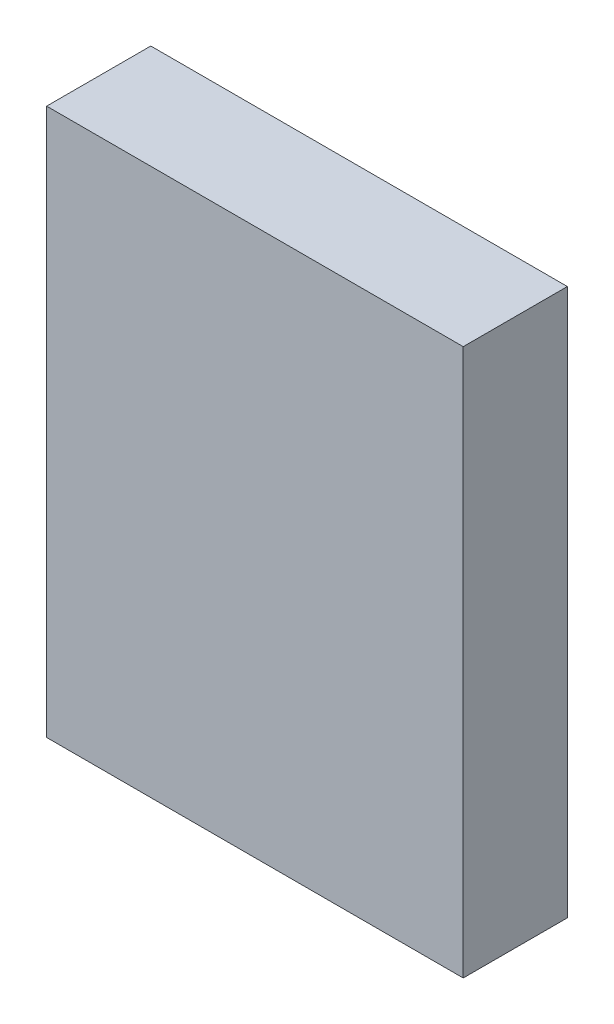
ISO-10303-21;
HEADER;
FILE_DESCRIPTION(('STEP AP214'),'2;1');
FILE_NAME('part.step','',(''),(''),'','','');
FILE_SCHEMA(('AUTOMOTIVE_DESIGN { 1 0 10303 214 1 1 1 1 }'));
ENDSEC;
DATA;
#1=APPLICATION_CONTEXT('core data for automotive mechanical design processes');
#2=APPLICATION_PROTOCOL_DEFINITION('international standard','automotive_design',2000,#1);
#3=PRODUCT_CONTEXT('',#1,'mechanical');
#4=PRODUCT('Part','Part','',(#3));
#5=PRODUCT_RELATED_PRODUCT_CATEGORY('part','',(#4));
#6=PRODUCT_DEFINITION_FORMATION('','',#4);
#7=PRODUCT_DEFINITION_CONTEXT('part definition',#1,'design');
#8=PRODUCT_DEFINITION('design','',#6,#7);
#9=PRODUCT_DEFINITION_SHAPE('','',#8);
#10=(LENGTH_UNIT() NAMED_UNIT(*) SI_UNIT(.MILLI.,.METRE.));
#11=(NAMED_UNIT(*) PLANE_ANGLE_UNIT() SI_UNIT($,.RADIAN.));
#12=(NAMED_UNIT(*) SI_UNIT($,.STERADIAN.) SOLID_ANGLE_UNIT());
#13=UNCERTAINTY_MEASURE_WITH_UNIT(LENGTH_MEASURE(1.E-05),#10,'distance_accuracy_value','');
#14=(GEOMETRIC_REPRESENTATION_CONTEXT(3) GLOBAL_UNCERTAINTY_ASSIGNED_CONTEXT((#13)) GLOBAL_UNIT_ASSIGNED_CONTEXT((#10,
#11,#12)) REPRESENTATION_CONTEXT('',''));
#15=CARTESIAN_POINT('',(0.,0.,0.));
#16=DIRECTION('',(0.,0.,1.));
#17=DIRECTION('',(1.,0.,0.));
#18=AXIS2_PLACEMENT_3D('',#15,#16,#17);
#19=CARTESIAN_POINT('',(1.425,2.3005,0.));
#20=DIRECTION('',(1.,0.,0.));
#21=DIRECTION('',(0.,0.,1.));
#22=AXIS2_PLACEMENT_3D('',#19,#20,#21);
#23=PLANE('',#22);
#24=DIRECTION('',(0.,1.,0.));
#25=VECTOR('',#24,1.);
#26=CARTESIAN_POINT('',(1.425,2.3005,0.1));
#27=LINE('',#26,#25);
#28=CARTESIAN_POINT('',(1.425,2.3005,0.1));
#29=VERTEX_POINT('',#28);
#30=CARTESIAN_POINT('',(1.425,2.8255,0.1));
#31=VERTEX_POINT('',#30);
#32=EDGE_CURVE('E11',#29,#31,#27,.T.);
#33=ORIENTED_EDGE('',*,*,#32,.T.);
#34=DIRECTION('',(0.,0.,1.));
#35=VECTOR('',#34,1.);
#36=CARTESIAN_POINT('',(1.425,2.8255,0.));
#37=LINE('',#36,#35);
#38=CARTESIAN_POINT('',(1.425,2.8255,0.));
#39=VERTEX_POINT('',#38);
#40=EDGE_CURVE('E24',#39,#31,#37,.T.);
#41=ORIENTED_EDGE('',*,*,#40,.F.);
#42=DIRECTION('',(0.,1.,0.));
#43=VECTOR('',#42,1.);
#44=CARTESIAN_POINT('',(1.425,2.3005,0.));
#45=LINE('',#44,#43);
#46=CARTESIAN_POINT('',(1.425,2.3005,0.));
#47=VERTEX_POINT('',#46);
#48=EDGE_CURVE('E86',#47,#39,#45,.T.);
#49=ORIENTED_EDGE('',*,*,#48,.F.);
#50=DIRECTION('',(0.,0.,1.));
#51=VECTOR('',#50,1.);
#52=CARTESIAN_POINT('',(1.425,2.3005,0.));
#53=LINE('',#52,#51);
#54=EDGE_CURVE('E36',#47,#29,#53,.T.);
#55=ORIENTED_EDGE('',*,*,#54,.T.);
#56=EDGE_LOOP('',(#33,#41,#49,#55));
#57=FACE_BOUND('',#56,.T.);
#58=ADVANCED_FACE('F17',(#57),#23,.F.);
#59=CARTESIAN_POINT('',(1.825,2.3005,0.));
#60=DIRECTION('',(1.,0.,0.));
#61=DIRECTION('',(0.,0.,1.));
#62=AXIS2_PLACEMENT_3D('',#59,#60,#61);
#63=PLANE('',#62);
#64=DIRECTION('',(0.,0.,1.));
#65=VECTOR('',#64,1.);
#66=CARTESIAN_POINT('',(1.825,2.3005,0.));
#67=LINE('',#66,#65);
#68=CARTESIAN_POINT('',(1.825,2.3005,0.));
#69=VERTEX_POINT('',#68);
#70=CARTESIAN_POINT('',(1.825,2.3005,0.1));
#71=VERTEX_POINT('',#70);
#72=EDGE_CURVE('E83',#69,#71,#67,.T.);
#73=ORIENTED_EDGE('',*,*,#72,.F.);
#74=DIRECTION('',(0.,1.,0.));
#75=VECTOR('',#74,1.);
#76=CARTESIAN_POINT('',(1.825,2.3005,0.));
#77=LINE('',#76,#75);
#78=CARTESIAN_POINT('',(1.825,2.8255,0.));
#79=VERTEX_POINT('',#78);
#80=EDGE_CURVE('E63',#69,#79,#77,.T.);
#81=ORIENTED_EDGE('',*,*,#80,.T.);
#82=DIRECTION('',(0.,0.,1.));
#83=VECTOR('',#82,1.);
#84=CARTESIAN_POINT('',(1.825,2.8255,0.));
#85=LINE('',#84,#83);
#86=CARTESIAN_POINT('',(1.825,2.8255,0.1));
#87=VERTEX_POINT('',#86);
#88=EDGE_CURVE('E57',#79,#87,#85,.T.);
#89=ORIENTED_EDGE('',*,*,#88,.T.);
#90=DIRECTION('',(0.,1.,0.));
#91=VECTOR('',#90,1.);
#92=CARTESIAN_POINT('',(1.825,2.3005,0.1));
#93=LINE('',#92,#91);
#94=EDGE_CURVE('E60',#71,#87,#93,.T.);
#95=ORIENTED_EDGE('',*,*,#94,.F.);
#96=EDGE_LOOP('',(#73,#81,#89,#95));
#97=FACE_BOUND('',#96,.T.);
#98=ADVANCED_FACE('F59',(#97),#63,.T.);
#99=CARTESIAN_POINT('',(1.425,2.3005,0.));
#100=DIRECTION('',(0.,1.,0.));
#101=DIRECTION('',(0.,0.,1.));
#102=AXIS2_PLACEMENT_3D('',#99,#100,#101);
#103=PLANE('',#102);
#104=ORIENTED_EDGE('',*,*,#72,.T.);
#105=DIRECTION('',(1.,0.,0.));
#106=VECTOR('',#105,1.);
#107=CARTESIAN_POINT('',(1.425,2.3005,0.1));
#108=LINE('',#107,#106);
#109=EDGE_CURVE('E71',#29,#71,#108,.T.);
#110=ORIENTED_EDGE('',*,*,#109,.F.);
#111=ORIENTED_EDGE('',*,*,#54,.F.);
#112=DIRECTION('',(1.,0.,0.));
#113=VECTOR('',#112,1.);
#114=CARTESIAN_POINT('',(1.425,2.3005,0.));
#115=LINE('',#114,#113);
#116=EDGE_CURVE('E76',#47,#69,#115,.T.);
#117=ORIENTED_EDGE('',*,*,#116,.T.);
#118=EDGE_LOOP('',(#104,#110,#111,#117));
#119=FACE_BOUND('',#118,.T.);
#120=ADVANCED_FACE('F91',(#119),#103,.F.);
#121=CARTESIAN_POINT('',(1.425,2.8255,0.));
#122=DIRECTION('',(0.,1.,0.));
#123=DIRECTION('',(0.,0.,1.));
#124=AXIS2_PLACEMENT_3D('',#121,#122,#123);
#125=PLANE('',#124);
#126=DIRECTION('',(1.,0.,0.));
#127=VECTOR('',#126,1.);
#128=CARTESIAN_POINT('',(1.425,2.8255,0.));
#129=LINE('',#128,#127);
#130=EDGE_CURVE('E74',#39,#79,#129,.T.);
#131=ORIENTED_EDGE('',*,*,#130,.F.);
#132=ORIENTED_EDGE('',*,*,#40,.T.);
#133=DIRECTION('',(1.,0.,0.));
#134=VECTOR('',#133,1.);
#135=CARTESIAN_POINT('',(1.425,2.8255,0.1));
#136=LINE('',#135,#134);
#137=EDGE_CURVE('E69',#31,#87,#136,.T.);
#138=ORIENTED_EDGE('',*,*,#137,.T.);
#139=ORIENTED_EDGE('',*,*,#88,.F.);
#140=EDGE_LOOP('',(#131,#132,#138,#139));
#141=FACE_BOUND('',#140,.T.);
#142=ADVANCED_FACE('F73',(#141),#125,.T.);
#143=CARTESIAN_POINT('',(1.425,2.3005,0.));
#144=DIRECTION('',(0.,0.,1.));
#145=DIRECTION('',(1.,0.,0.));
#146=AXIS2_PLACEMENT_3D('',#143,#144,#145);
#147=PLANE('',#146);
#148=ORIENTED_EDGE('',*,*,#130,.T.);
#149=ORIENTED_EDGE('',*,*,#80,.F.);
#150=ORIENTED_EDGE('',*,*,#116,.F.);
#151=ORIENTED_EDGE('',*,*,#48,.T.);
#152=EDGE_LOOP('',(#148,#149,#150,#151));
#153=FACE_BOUND('',#152,.T.);
#154=ADVANCED_FACE('F89',(#153),#147,.F.);
#155=CARTESIAN_POINT('',(1.425,2.3005,0.1));
#156=DIRECTION('',(0.,0.,1.));
#157=DIRECTION('',(1.,0.,0.));
#158=AXIS2_PLACEMENT_3D('',#155,#156,#157);
#159=PLANE('',#158);
#160=ORIENTED_EDGE('',*,*,#32,.F.);
#161=ORIENTED_EDGE('',*,*,#109,.T.);
#162=ORIENTED_EDGE('',*,*,#94,.T.);
#163=ORIENTED_EDGE('',*,*,#137,.F.);
#164=EDGE_LOOP('',(#160,#161,#162,#163));
#165=FACE_BOUND('',#164,.T.);
#166=ADVANCED_FACE('F68',(#165),#159,.T.);
#167=CLOSED_SHELL('',(#58,#98,#120,#142,#154,#166));
#168=MANIFOLD_SOLID_BREP('B1',#167);
#169=ADVANCED_BREP_SHAPE_REPRESENTATION('',(#18,#168),#14);
#170=SHAPE_DEFINITION_REPRESENTATION(#9,#169);
ENDSEC;
END-ISO-10303-21;
